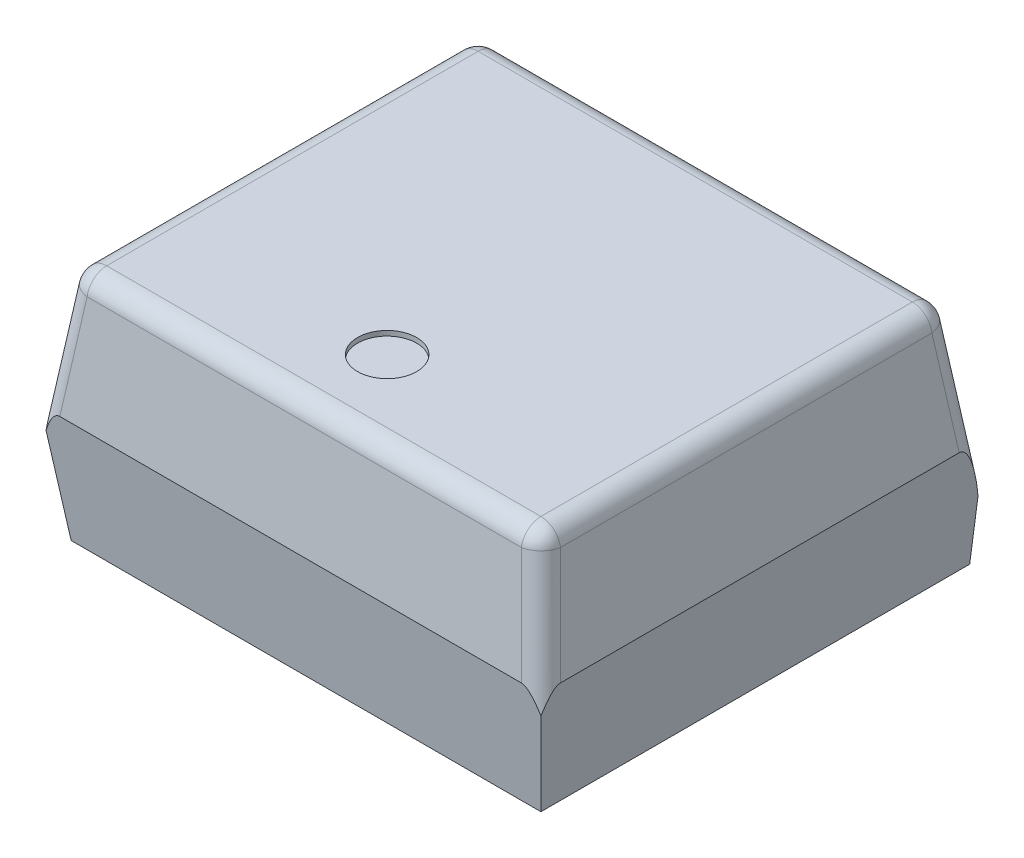
ISO-10303-21;
HEADER;
FILE_DESCRIPTION(('STEP AP214'),'2;1');
FILE_NAME('part.step','',(''),(''),'','','');
FILE_SCHEMA(('AUTOMOTIVE_DESIGN { 1 0 10303 214 1 1 1 1 }'));
ENDSEC;
DATA;
#1=APPLICATION_CONTEXT('core data for automotive mechanical design processes');
#2=APPLICATION_PROTOCOL_DEFINITION('international standard','automotive_design',2000,#1);
#3=PRODUCT_CONTEXT('',#1,'mechanical');
#4=PRODUCT('Part','Part','',(#3));
#5=PRODUCT_RELATED_PRODUCT_CATEGORY('part','',(#4));
#6=PRODUCT_DEFINITION_FORMATION('','',#4);
#7=PRODUCT_DEFINITION_CONTEXT('part definition',#1,'design');
#8=PRODUCT_DEFINITION('design','',#6,#7);
#9=PRODUCT_DEFINITION_SHAPE('','',#8);
#10=(LENGTH_UNIT() NAMED_UNIT(*) SI_UNIT(.MILLI.,.METRE.));
#11=(NAMED_UNIT(*) PLANE_ANGLE_UNIT() SI_UNIT($,.RADIAN.));
#12=(NAMED_UNIT(*) SI_UNIT($,.STERADIAN.) SOLID_ANGLE_UNIT());
#13=UNCERTAINTY_MEASURE_WITH_UNIT(LENGTH_MEASURE(1.E-05),#10,'distance_accuracy_value','');
#14=(GEOMETRIC_REPRESENTATION_CONTEXT(3) GLOBAL_UNCERTAINTY_ASSIGNED_CONTEXT((#13)) GLOBAL_UNIT_ASSIGNED_CONTEXT((#10,
#11,#12)) REPRESENTATION_CONTEXT('',''));
#15=CARTESIAN_POINT('',(0.,0.,0.));
#16=DIRECTION('',(0.,0.,1.));
#17=DIRECTION('',(1.,0.,0.));
#18=AXIS2_PLACEMENT_3D('',#15,#16,#17);
#19=CARTESIAN_POINT('',(-4.406529143216,2.051,0.));
#20=DIRECTION('',(0.,0.,0.999999999999986));
#21=DIRECTION('',(-0.659345815100005,0.751839807479021,0.));
#22=AXIS2_PLACEMENT_3D('',#19,#20,#21);
#23=CYLINDRICAL_SURFACE('',#22,0.4);
#24=CARTESIAN_POINT('',(-4.40652914321622,2.051,-3.834029143216));
#25=DIRECTION('',(0.,0.,0.999999999999986));
#26=DIRECTION('',(0.,1.,0.));
#27=AXIS2_PLACEMENT_3D('',#24,#25,#26);
#28=CIRCLE('',#27,0.4);
#29=CARTESIAN_POINT('',(-4.40652914321622,2.451,-3.834029143216));
#30=VERTEX_POINT('',#29);
#31=CARTESIAN_POINT('',(-4.803107087766,2.103210476888,-3.834029143216));
#32=VERTEX_POINT('',#31);
#33=EDGE_CURVE('E11',#30,#32,#28,.T.);
#34=ORIENTED_EDGE('',*,*,#33,.T.);
#35=DIRECTION('',(0.,0.,0.999999999999986));
#36=VECTOR('',#35,1.);
#37=CARTESIAN_POINT('',(-4.803107087766,2.103210476888,0.));
#38=LINE('',#37,#36);
#39=CARTESIAN_POINT('',(-4.80310708776578,2.103210476888,3.70402914321512));
#40=VERTEX_POINT('',#39);
#41=EDGE_CURVE('E27',#32,#40,#38,.T.);
#42=ORIENTED_EDGE('',*,*,#41,.T.);
#43=CARTESIAN_POINT('',(-4.406529143216,2.051,3.70402914321513));
#44=DIRECTION('',(0.,0.,-0.999999999999986));
#45=DIRECTION('',(-0.991444861373806,0.130526192219976,0.));
#46=AXIS2_PLACEMENT_3D('',#43,#44,#45);
#47=CIRCLE('',#46,0.4);
#48=CARTESIAN_POINT('',(-4.406529143216,2.451,3.70402914321513));
#49=VERTEX_POINT('',#48);
#50=EDGE_CURVE('E382',#40,#49,#47,.T.);
#51=ORIENTED_EDGE('',*,*,#50,.T.);
#52=DIRECTION('',(0.,0.,-0.999999999999986));
#53=VECTOR('',#52,1.);
#54=CARTESIAN_POINT('',(-4.406529143216,2.451,0.));
#55=LINE('',#54,#53);
#56=EDGE_CURVE('E216',#49,#30,#55,.T.);
#57=ORIENTED_EDGE('',*,*,#56,.T.);
#58=EDGE_LOOP('',(#34,#42,#51,#57));
#59=FACE_BOUND('',#58,.T.);
#60=ADVANCED_FACE('F16',(#59),#23,.T.);
#61=CARTESIAN_POINT('',(-5.08000000000022,2.051,-3.834029143216));
#62=DIRECTION('',(-0.999999999999986,0.,0.));
#63=DIRECTION('',(0.,0.751839807479021,-0.659345815100019));
#64=AXIS2_PLACEMENT_3D('',#61,#62,#63);
#65=CYLINDRICAL_SURFACE('',#64,0.4);
#66=CARTESIAN_POINT('',(4.40652914321589,2.051,-3.83402914321514));
#67=DIRECTION('',(-0.999999999999986,0.,0.));
#68=DIRECTION('',(0.,1.,0.));
#69=AXIS2_PLACEMENT_3D('',#66,#67,#68);
#70=CIRCLE('',#69,0.4);
#71=CARTESIAN_POINT('',(4.40652914321589,2.451,-3.83402914321514));
#72=VERTEX_POINT('',#71);
#73=CARTESIAN_POINT('',(4.40652914321589,2.103210476888,-4.23060708776513));
#74=VERTEX_POINT('',#73);
#75=EDGE_CURVE('E204',#72,#74,#70,.T.);
#76=ORIENTED_EDGE('',*,*,#75,.T.);
#77=DIRECTION('',(-0.999999999999986,0.,0.));
#78=VECTOR('',#77,1.);
#79=CARTESIAN_POINT('',(-5.07999999999978,2.103210476888,-4.230607087766));
#80=LINE('',#79,#78);
#81=CARTESIAN_POINT('',(-4.406529143216,2.103210476888,-4.230607087766));
#82=VERTEX_POINT('',#81);
#83=EDGE_CURVE('E217',#74,#82,#80,.T.);
#84=ORIENTED_EDGE('',*,*,#83,.T.);
#85=CARTESIAN_POINT('',(-4.40652914321622,2.051,-3.834029143216));
#86=DIRECTION('',(0.999999999999986,0.,0.));
#87=DIRECTION('',(0.,0.130526192219976,-0.991444861373806));
#88=AXIS2_PLACEMENT_3D('',#85,#86,#87);
#89=CIRCLE('',#88,0.4);
#90=EDGE_CURVE('E206',#82,#30,#89,.T.);
#91=ORIENTED_EDGE('',*,*,#90,.T.);
#92=DIRECTION('',(0.999999999999986,0.,0.));
#93=VECTOR('',#92,1.);
#94=CARTESIAN_POINT('',(-5.08000000000022,2.451,-3.834029143216));
#95=LINE('',#94,#93);
#96=EDGE_CURVE('E201',#30,#72,#95,.T.);
#97=ORIENTED_EDGE('',*,*,#96,.T.);
#98=EDGE_LOOP('',(#76,#84,#91,#97));
#99=FACE_BOUND('',#98,.T.);
#100=ADVANCED_FACE('F202',(#99),#65,.T.);
#101=CARTESIAN_POINT('',(-4.40652914321622,2.051,-3.834029143216));
#102=DIRECTION('',(0.,0.,0.999999999999986));
#103=DIRECTION('',(0.999999999999986,0.,0.));
#104=AXIS2_PLACEMENT_3D('',#101,#102,#103);
#105=SPHERICAL_SURFACE('',#104,0.4);
#106=ORIENTED_EDGE('',*,*,#90,.F.);
#107=CARTESIAN_POINT('',(-4.40652914321622,2.051,-3.834029143216));
#108=DIRECTION('',(0.129428307995397,0.983105602760403,0.129428307995397));
#109=DIRECTION('',(-0.695160638334369,0.183039268522097,-0.695160638334369));
#110=AXIS2_PLACEMENT_3D('',#107,#108,#109);
#111=CIRCLE('',#110,0.4);
#112=EDGE_CURVE('E41',#82,#32,#111,.T.);
#113=ORIENTED_EDGE('',*,*,#112,.T.);
#114=ORIENTED_EDGE('',*,*,#33,.F.);
#115=EDGE_LOOP('',(#106,#113,#114));
#116=FACE_BOUND('',#115,.T.);
#117=ADVANCED_FACE('F875',(#116),#105,.T.);
#118=CARTESIAN_POINT('',(4.406529143216,2.051,-8.74300631892311E-13));
#119=DIRECTION('',(0.,0.,-0.999999999999986));
#120=DIRECTION('',(0.659345815100005,0.751839807479021,0.));
#121=AXIS2_PLACEMENT_3D('',#118,#119,#120);
#122=CYLINDRICAL_SURFACE('',#121,0.4);
#123=CARTESIAN_POINT('',(4.40652914321589,2.051,3.70402914321601));
#124=DIRECTION('',(0.,0.,-0.999999999999986));
#125=DIRECTION('',(0.,1.,0.));
#126=AXIS2_PLACEMENT_3D('',#123,#124,#125);
#127=CIRCLE('',#126,0.4);
#128=CARTESIAN_POINT('',(4.40652914321589,2.451,3.70402914321601));
#129=VERTEX_POINT('',#128);
#130=CARTESIAN_POINT('',(4.80310708776589,2.103210476888,3.70402914321512));
#131=VERTEX_POINT('',#130);
#132=EDGE_CURVE('E367',#129,#131,#127,.T.);
#133=ORIENTED_EDGE('',*,*,#132,.T.);
#134=DIRECTION('',(0.,0.,-0.999999999999986));
#135=VECTOR('',#134,1.);
#136=CARTESIAN_POINT('',(4.80310708776578,2.103210476888,8.74300631892311E-13));
#137=LINE('',#136,#135);
#138=CARTESIAN_POINT('',(4.80310708776578,2.103210476888,-3.834029143216));
#139=VERTEX_POINT('',#138);
#140=EDGE_CURVE('E191',#131,#139,#137,.T.);
#141=ORIENTED_EDGE('',*,*,#140,.T.);
#142=CARTESIAN_POINT('',(4.40652914321589,2.051,-3.83402914321514));
#143=DIRECTION('',(0.,0.,0.999999999999986));
#144=DIRECTION('',(0.991444861373806,0.130526192219976,0.));
#145=AXIS2_PLACEMENT_3D('',#142,#143,#144);
#146=CIRCLE('',#145,0.4);
#147=EDGE_CURVE('E183',#139,#72,#146,.T.);
#148=ORIENTED_EDGE('',*,*,#147,.T.);
#149=DIRECTION('',(0.,0.,0.999999999999986));
#150=VECTOR('',#149,1.);
#151=CARTESIAN_POINT('',(4.406529143216,2.451,-8.74300631892311E-13));
#152=LINE('',#151,#150);
#153=EDGE_CURVE('E188',#72,#129,#152,.T.);
#154=ORIENTED_EDGE('',*,*,#153,.T.);
#155=EDGE_LOOP('',(#133,#141,#148,#154));
#156=FACE_BOUND('',#155,.T.);
#157=ADVANCED_FACE('F186',(#156),#122,.T.);
#158=CARTESIAN_POINT('',(4.40652914321589,2.051,-3.83402914321514));
#159=DIRECTION('',(0.,0.,0.999999999999986));
#160=DIRECTION('',(0.999999999999986,0.,0.));
#161=AXIS2_PLACEMENT_3D('',#158,#159,#160);
#162=SPHERICAL_SURFACE('',#161,0.4);
#163=ORIENTED_EDGE('',*,*,#147,.F.);
#164=CARTESIAN_POINT('',(4.40652914321589,2.051,-3.83402914321514));
#165=DIRECTION('',(-0.129428307995397,0.983105602760403,0.129428307995395));
#166=DIRECTION('',(0.695160638334369,0.183039268522097,-0.695160638334369));
#167=AXIS2_PLACEMENT_3D('',#164,#165,#166);
#168=CIRCLE('',#167,0.4);
#169=EDGE_CURVE('E213',#139,#74,#168,.T.);
#170=ORIENTED_EDGE('',*,*,#169,.T.);
#171=ORIENTED_EDGE('',*,*,#75,.F.);
#172=EDGE_LOOP('',(#163,#170,#171));
#173=FACE_BOUND('',#172,.T.);
#174=ADVANCED_FACE('F212',(#173),#162,.T.);
#175=CARTESIAN_POINT('',(-5.08,2.051,3.70402914321512));
#176=DIRECTION('',(0.999999999999986,0.,0.));
#177=DIRECTION('',(0.,0.751839807479021,0.659345815100005));
#178=AXIS2_PLACEMENT_3D('',#175,#176,#177);
#179=CYLINDRICAL_SURFACE('',#178,0.4);
#180=CARTESIAN_POINT('',(-4.406529143216,2.051,3.70402914321513));
#181=DIRECTION('',(0.999999999999986,0.,0.));
#182=DIRECTION('',(0.,1.,0.));
#183=AXIS2_PLACEMENT_3D('',#180,#181,#182);
#184=CIRCLE('',#183,0.4);
#185=CARTESIAN_POINT('',(-4.406529143216,2.103210476888,4.10060708776601));
#186=VERTEX_POINT('',#185);
#187=EDGE_CURVE('E229',#49,#186,#184,.T.);
#188=ORIENTED_EDGE('',*,*,#187,.T.);
#189=DIRECTION('',(0.999999999999986,0.,0.));
#190=VECTOR('',#189,1.);
#191=CARTESIAN_POINT('',(-5.08,2.103210476888,4.10060708776512));
#192=LINE('',#191,#190);
#193=CARTESIAN_POINT('',(4.40652914321589,2.103210476888,4.100607087766));
#194=VERTEX_POINT('',#193);
#195=EDGE_CURVE('E318',#186,#194,#192,.T.);
#196=ORIENTED_EDGE('',*,*,#195,.T.);
#197=CARTESIAN_POINT('',(4.40652914321589,2.051,3.70402914321601));
#198=DIRECTION('',(-0.999999999999986,0.,0.));
#199=DIRECTION('',(0.,0.130526192219976,0.991444861373806));
#200=AXIS2_PLACEMENT_3D('',#197,#198,#199);
#201=CIRCLE('',#200,0.4);
#202=EDGE_CURVE('E322',#194,#129,#201,.T.);
#203=ORIENTED_EDGE('',*,*,#202,.T.);
#204=DIRECTION('',(-0.999999999999986,0.,0.));
#205=VECTOR('',#204,1.);
#206=CARTESIAN_POINT('',(-5.08,2.451,3.70402914321512));
#207=LINE('',#206,#205);
#208=EDGE_CURVE('E222',#129,#49,#207,.T.);
#209=ORIENTED_EDGE('',*,*,#208,.T.);
#210=EDGE_LOOP('',(#188,#196,#203,#209));
#211=FACE_BOUND('',#210,.T.);
#212=ADVANCED_FACE('F851',(#211),#179,.T.);
#213=CARTESIAN_POINT('',(4.40652914321589,2.051,3.70402914321601));
#214=DIRECTION('',(0.,0.,0.999999999999986));
#215=DIRECTION('',(0.999999999999986,0.,0.));
#216=AXIS2_PLACEMENT_3D('',#213,#214,#215);
#217=SPHERICAL_SURFACE('',#216,0.4);
#218=ORIENTED_EDGE('',*,*,#202,.F.);
#219=CARTESIAN_POINT('',(4.40652914321589,2.051,3.70402914321601));
#220=DIRECTION('',(-0.129428307995397,0.983105602760403,-0.129428307995395));
#221=DIRECTION('',(0.695160638334369,0.183039268522097,0.695160638334369));
#222=AXIS2_PLACEMENT_3D('',#219,#220,#221);
#223=CIRCLE('',#222,0.4);
#224=EDGE_CURVE('E410',#194,#131,#223,.T.);
#225=ORIENTED_EDGE('',*,*,#224,.T.);
#226=ORIENTED_EDGE('',*,*,#132,.F.);
#227=EDGE_LOOP('',(#218,#225,#226));
#228=FACE_BOUND('',#227,.T.);
#229=ADVANCED_FACE('F843',(#228),#217,.T.);
#230=CARTESIAN_POINT('',(-4.406529143216,2.051,3.70402914321513));
#231=DIRECTION('',(0.,0.,0.999999999999986));
#232=DIRECTION('',(0.999999999999986,0.,0.));
#233=AXIS2_PLACEMENT_3D('',#230,#231,#232);
#234=SPHERICAL_SURFACE('',#233,0.4);
#235=ORIENTED_EDGE('',*,*,#50,.F.);
#236=CARTESIAN_POINT('',(-4.406529143216,2.051,3.70402914321513));
#237=DIRECTION('',(0.129428307995397,0.983105602760403,-0.129428307995397));
#238=DIRECTION('',(-0.695160638334369,0.183039268522097,0.695160638334369));
#239=AXIS2_PLACEMENT_3D('',#236,#237,#238);
#240=CIRCLE('',#239,0.4);
#241=EDGE_CURVE('E357',#40,#186,#240,.T.);
#242=ORIENTED_EDGE('',*,*,#241,.T.);
#243=ORIENTED_EDGE('',*,*,#187,.F.);
#244=EDGE_LOOP('',(#235,#242,#243));
#245=FACE_BOUND('',#244,.T.);
#246=ADVANCED_FACE('F526',(#245),#234,.T.);
#247=CARTESIAN_POINT('',(4.60496683550689,0.543716082658997,-4.032466835507));
#248=DIRECTION('',(0.129428307995397,-0.983105602760403,-0.129428307995395));
#249=DIRECTION('',(0.695160638334369,0.183039268522097,-0.695160638334369));
#250=AXIS2_PLACEMENT_3D('',#247,#248,#249);
#251=CYLINDRICAL_SURFACE('',#250,0.4);
#252=ORIENTED_EDGE('',*,*,#169,.F.);
#253=DIRECTION('',(0.129428307996028,-0.983105602760237,-0.129428307996026));
#254=VECTOR('',#253,1.);
#255=CARTESIAN_POINT('',(5.00154478005667,0.595926559547003,-4.03246683550613));
#256=LINE('',#255,#254);
#257=CARTESIAN_POINT('',(5.07999999999978,0.,-4.11092205545));
#258=VERTEX_POINT('',#257);
#259=EDGE_CURVE('E347',#139,#258,#256,.T.);
#260=ORIENTED_EDGE('',*,*,#259,.T.);
#261=CARTESIAN_POINT('',(4.87827420788378,-1.532259515108,-4.30577420788314));
#262=DIRECTION('',(-0.991444861373769,0.130526192220259,0.));
#263=DIRECTION('',(0.12935054531996,0.982514936595735,0.133913538492961));
#264=AXIS2_PLACEMENT_3D('',#261,#262,#263);
#265=ELLIPSE('',#264,1.558590970091,0.4);
#266=CARTESIAN_POINT('',(4.93516796659378,-1.10010851339556,-4.637835972612));
#267=VERTEX_POINT('',#266);
#268=EDGE_CURVE('E344',#258,#267,#265,.T.);
#269=ORIENTED_EDGE('',*,*,#268,.T.);
#270=CARTESIAN_POINT('',(5.21033597261156,-4.05451903021557,-4.637835972612));
#271=DIRECTION('',(0.,0.,0.999999999999986));
#272=DIRECTION('',(-0.130526192219973,0.99144486137382,0.));
#273=AXIS2_PLACEMENT_3D('',#270,#271,#272);
#274=ELLIPSE('',#273,3.09051401656,0.4);
#275=CARTESIAN_POINT('',(4.81375802806167,-0.989999999999561,-4.63783597261114));
#276=VERTEX_POINT('',#275);
#277=EDGE_CURVE('E304',#267,#276,#274,.T.);
#278=ORIENTED_EDGE('',*,*,#277,.T.);
#279=DIRECTION('',(-0.129428307996028,0.983105602760237,0.129428307996026));
#280=VECTOR('',#279,1.);
#281=CARTESIAN_POINT('',(4.60496683550689,0.59592655954744,-4.429044780057));
#282=LINE('',#281,#280);
#283=EDGE_CURVE('E301',#276,#74,#282,.T.);
#284=ORIENTED_EDGE('',*,*,#283,.T.);
#285=EDGE_LOOP('',(#252,#260,#269,#278,#284));
#286=FACE_BOUND('',#285,.T.);
#287=ADVANCED_FACE('F826',(#286),#251,.T.);
#288=CARTESIAN_POINT('',(5.07999999999978,4.37150315946155E-13,-4.5075));
#289=DIRECTION('',(0.991444861373806,0.130526192219976,0.));
#290=DIRECTION('',(0.,0.,-0.999999999999986));
#291=AXIS2_PLACEMENT_3D('',#288,#289,#290);
#292=PLANE('',#291);
#293=ORIENTED_EDGE('',*,*,#140,.F.);
#294=DIRECTION('',(-0.129428307996028,0.983105602760237,-0.129428307996026));
#295=VECTOR('',#294,1.);
#296=CARTESIAN_POINT('',(4.92712541095689,1.161197788458,3.82804746640526));
#297=LINE('',#296,#295);
#298=CARTESIAN_POINT('',(5.07999999999978,0.,3.98092205544912));
#299=VERTEX_POINT('',#298);
#300=EDGE_CURVE('E246',#299,#131,#297,.T.);
#301=ORIENTED_EDGE('',*,*,#300,.F.);
#302=DIRECTION('',(0.,0.,-0.999999999999986));
#303=VECTOR('',#302,1.);
#304=CARTESIAN_POINT('',(5.07999999999978,4.37150315946155E-13,-4.5075));
#305=LINE('',#304,#303);
#306=EDGE_CURVE('E305',#299,#258,#305,.T.);
#307=ORIENTED_EDGE('',*,*,#306,.T.);
#308=ORIENTED_EDGE('',*,*,#259,.F.);
#309=EDGE_LOOP('',(#293,#301,#307,#308));
#310=FACE_BOUND('',#309,.T.);
#311=ADVANCED_FACE('F817',(#310),#292,.T.);
#312=CARTESIAN_POINT('',(4.530547466407,1.10898731157,3.828047466407));
#313=DIRECTION('',(0.129428307995397,-0.983105602760403,0.129428307995395));
#314=DIRECTION('',(0.695160638334369,0.183039268522097,0.695160638334369));
#315=AXIS2_PLACEMENT_3D('',#312,#313,#314);
#316=CYLINDRICAL_SURFACE('',#315,0.4);
#317=ORIENTED_EDGE('',*,*,#224,.F.);
#318=DIRECTION('',(0.129428307996028,-0.983105602760237,0.129428307996026));
#319=VECTOR('',#318,1.);
#320=CARTESIAN_POINT('',(4.53054746640711,1.161197788458,4.224625410957));
#321=LINE('',#320,#319);
#322=CARTESIAN_POINT('',(4.68342205544989,0.,4.37750000000001));
#323=VERTEX_POINT('',#322);
#324=EDGE_CURVE('E397',#194,#323,#321,.T.);
#325=ORIENTED_EDGE('',*,*,#324,.T.);
#326=CARTESIAN_POINT('',(4.87827420788367,-1.532259515108,4.175774207884));
#327=DIRECTION('',(0.,0.130526192220259,-0.991444861373769));
#328=DIRECTION('',(-0.133913538492962,0.982514936595735,0.129350545319962));
#329=AXIS2_PLACEMENT_3D('',#326,#327,#328);
#330=ELLIPSE('',#329,1.558590970091,0.4);
#331=CARTESIAN_POINT('',(5.02212585092178,-0.439597805876997,4.31962585092201));
#332=VERTEX_POINT('',#331);
#333=EDGE_CURVE('E393',#323,#332,#330,.T.);
#334=ORIENTED_EDGE('',*,*,#333,.T.);
#335=CARTESIAN_POINT('',(4.87827420788367,-1.532259515108,4.175774207884));
#336=DIRECTION('',(-0.991444861373769,0.130526192220259,0.));
#337=DIRECTION('',(0.12935054531996,0.982514936595735,-0.133913538492961));
#338=AXIS2_PLACEMENT_3D('',#335,#336,#337);
#339=ELLIPSE('',#338,1.558590970091,0.4);
#340=EDGE_CURVE('E288',#332,#299,#339,.T.);
#341=ORIENTED_EDGE('',*,*,#340,.T.);
#342=ORIENTED_EDGE('',*,*,#300,.T.);
#343=EDGE_LOOP('',(#317,#325,#334,#341,#342));
#344=FACE_BOUND('',#343,.T.);
#345=ADVANCED_FACE('F809',(#344),#316,.T.);
#346=CARTESIAN_POINT('',(-5.08,0.,4.37749999999912));
#347=DIRECTION('',(0.,0.130526192219976,0.991444861373806));
#348=DIRECTION('',(0.999999999999986,0.,0.));
#349=AXIS2_PLACEMENT_3D('',#346,#347,#348);
#350=PLANE('',#349);
#351=ORIENTED_EDGE('',*,*,#195,.F.);
#352=DIRECTION('',(0.129428307996028,0.983105602760237,-0.129428307996028));
#353=VECTOR('',#352,1.);
#354=CARTESIAN_POINT('',(-4.615646035913,0.514809979146998,4.30972398046199));
#355=LINE('',#354,#353);
#356=CARTESIAN_POINT('',(-4.68342205545001,0.,4.37750000000001));
#357=VERTEX_POINT('',#356);
#358=EDGE_CURVE('E289',#357,#186,#355,.T.);
#359=ORIENTED_EDGE('',*,*,#358,.F.);
#360=DIRECTION('',(0.999999999999986,0.,0.));
#361=VECTOR('',#360,1.);
#362=CARTESIAN_POINT('',(-5.08,0.,4.37749999999912));
#363=LINE('',#362,#361);
#364=EDGE_CURVE('E237',#357,#323,#363,.T.);
#365=ORIENTED_EDGE('',*,*,#364,.T.);
#366=ORIENTED_EDGE('',*,*,#324,.F.);
#367=EDGE_LOOP('',(#351,#359,#365,#366));
#368=FACE_BOUND('',#367,.T.);
#369=ADVANCED_FACE('F523',(#368),#350,.T.);
#370=CARTESIAN_POINT('',(-5.07999999999978,2.451,4.5075));
#371=DIRECTION('',(0.,1.,0.));
#372=DIRECTION('',(0.999999999999986,0.,0.));
#373=AXIS2_PLACEMENT_3D('',#370,#371,#372);
#374=PLANE('',#373);
#375=ORIENTED_EDGE('',*,*,#56,.F.);
#376=ORIENTED_EDGE('',*,*,#208,.F.);
#377=ORIENTED_EDGE('',*,*,#153,.F.);
#378=ORIENTED_EDGE('',*,*,#96,.F.);
#379=EDGE_LOOP('',(#375,#376,#377,#378));
#380=FACE_BOUND('',#379,.T.);
#381=CARTESIAN_POINT('',(0.,2.451,2.41892237669));
#382=DIRECTION('',(0.,-1.,0.));
#383=DIRECTION('',(-0.999999999999986,0.,0.));
#384=AXIS2_PLACEMENT_3D('',#381,#382,#383);
#385=CIRCLE('',#384,0.6);
#386=CARTESIAN_POINT('',(0.599999999999891,2.451,2.41892237668825));
#387=VERTEX_POINT('',#386);
#388=EDGE_CURVE('E234',#387,#387,#385,.T.);
#389=ORIENTED_EDGE('',*,*,#388,.T.);
#390=EDGE_LOOP('',(#389));
#391=FACE_BOUND('',#390,.T.);
#392=ADVANCED_FACE('F18',(#380,#391),#374,.T.);
#393=CARTESIAN_POINT('',(-4.690065405013,-0.102671726651002,-4.11756540501212));
#394=DIRECTION('',(-0.129428307995397,-0.983105602760403,-0.129428307995397));
#395=DIRECTION('',(-0.695160638334369,0.183039268522097,-0.695160638334369));
#396=AXIS2_PLACEMENT_3D('',#393,#394,#395);
#397=CYLINDRICAL_SURFACE('',#396,0.4);
#398=ORIENTED_EDGE('',*,*,#112,.F.);
#399=DIRECTION('',(-0.129428307996028,-0.983105602760237,-0.129428307996028));
#400=VECTOR('',#399,1.);
#401=CARTESIAN_POINT('',(-4.69006540501321,-0.0504612497630244,-4.51414334956213));
#402=LINE('',#401,#400);
#403=CARTESIAN_POINT('',(-4.81375802806179,-0.989999999999561,-4.637835972612));
#404=VERTEX_POINT('',#403);
#405=EDGE_CURVE('E238',#82,#404,#402,.T.);
#406=ORIENTED_EDGE('',*,*,#405,.T.);
#407=CARTESIAN_POINT('',(-5.21033597261178,-4.05451903021557,-4.63783597261115));
#408=DIRECTION('',(0.,0.,0.999999999999986));
#409=DIRECTION('',(0.130526192219973,0.99144486137382,0.));
#410=AXIS2_PLACEMENT_3D('',#407,#408,#409);
#411=ELLIPSE('',#410,3.09051401656,0.4);
#412=CARTESIAN_POINT('',(-4.93516796659379,-1.10010851339556,-4.63783597261114));
#413=VERTEX_POINT('',#412);
#414=EDGE_CURVE('E249',#404,#413,#411,.T.);
#415=ORIENTED_EDGE('',*,*,#414,.T.);
#416=CARTESIAN_POINT('',(-4.87827420788378,-1.532259515108,-4.305774207884));
#417=DIRECTION('',(0.991444861373769,0.130526192220259,0.));
#418=DIRECTION('',(-0.12935054531996,0.982514936595735,0.133913538492962));
#419=AXIS2_PLACEMENT_3D('',#416,#417,#418);
#420=ELLIPSE('',#419,1.558590970091,0.4);
#421=CARTESIAN_POINT('',(-5.07999999999978,0.,-4.11092205545));
#422=VERTEX_POINT('',#421);
#423=EDGE_CURVE('E258',#413,#422,#420,.T.);
#424=ORIENTED_EDGE('',*,*,#423,.T.);
#425=DIRECTION('',(0.129428307996028,0.983105602760237,0.129428307996028));
#426=VECTOR('',#425,1.);
#427=CARTESIAN_POINT('',(-5.086643349563,-0.0504612497634616,-4.117565405013));
#428=LINE('',#427,#426);
#429=EDGE_CURVE('E390',#422,#32,#428,.T.);
#430=ORIENTED_EDGE('',*,*,#429,.T.);
#431=EDGE_LOOP('',(#398,#406,#415,#424,#430));
#432=FACE_BOUND('',#431,.T.);
#433=ADVANCED_FACE('F531',(#432),#397,.T.);
#434=CARTESIAN_POINT('',(-5.07999999999978,4.37150315946155E-13,-4.5075));
#435=DIRECTION('',(-0.991444861373806,0.130526192219976,0.));
#436=DIRECTION('',(0.,0.,0.999999999999986));
#437=AXIS2_PLACEMENT_3D('',#434,#435,#436);
#438=PLANE('',#437);
#439=ORIENTED_EDGE('',*,*,#41,.F.);
#440=ORIENTED_EDGE('',*,*,#429,.F.);
#441=DIRECTION('',(0.,0.,0.999999999999986));
#442=VECTOR('',#441,1.);
#443=CARTESIAN_POINT('',(-5.07999999999978,4.37150315946155E-13,-4.5075));
#444=LINE('',#443,#442);
#445=CARTESIAN_POINT('',(-5.07999999999978,0.,3.98092205544912));
#446=VERTEX_POINT('',#445);
#447=EDGE_CURVE('E386',#422,#446,#444,.T.);
#448=ORIENTED_EDGE('',*,*,#447,.T.);
#449=DIRECTION('',(-0.129428307996028,-0.983105602760237,0.129428307996028));
#450=VECTOR('',#449,1.);
#451=CARTESIAN_POINT('',(-5.01222398046179,0.514809979146998,3.91314603591213));
#452=LINE('',#451,#450);
#453=EDGE_CURVE('E338',#40,#446,#452,.T.);
#454=ORIENTED_EDGE('',*,*,#453,.F.);
#455=EDGE_LOOP('',(#439,#440,#448,#454));
#456=FACE_BOUND('',#455,.T.);
#457=ADVANCED_FACE('F529',(#456),#438,.T.);
#458=CARTESIAN_POINT('',(-5.07999999999978,4.37150315946155E-13,-4.5075));
#459=DIRECTION('',(-0.991444861373806,-0.130526192219976,0.));
#460=DIRECTION('',(-0.130526192219973,0.99144486137382,0.));
#461=AXIS2_PLACEMENT_3D('',#458,#459,#460);
#462=PLANE('',#461);
#463=ORIENTED_EDGE('',*,*,#423,.F.);
#464=DIRECTION('',(0.130526192219973,-0.99144486137382,0.));
#465=VECTOR('',#464,1.);
#466=CARTESIAN_POINT('',(-4.92496357075878,-1.17761859503256,-4.637835972612));
#467=LINE('',#466,#465);
#468=CARTESIAN_POINT('',(-4.76681187348921,-2.37889999999957,-4.637835972612));
#469=VERTEX_POINT('',#468);
#470=EDGE_CURVE('E232',#413,#469,#467,.T.);
#471=ORIENTED_EDGE('',*,*,#470,.T.);
#472=DIRECTION('',(0.,0.,0.999999999999986));
#473=VECTOR('',#472,1.);
#474=CARTESIAN_POINT('',(-4.766811873489,-2.3789,-2.13111952145513));
#475=LINE('',#474,#473);
#476=CARTESIAN_POINT('',(-4.76681187348878,-2.3789,4.06431187348813));
#477=VERTEX_POINT('',#476);
#478=EDGE_CURVE('E337',#469,#477,#475,.T.);
#479=ORIENTED_EDGE('',*,*,#478,.T.);
#480=DIRECTION('',(-0.129428307996028,0.983105602760237,0.129428307996026));
#481=VECTOR('',#480,1.);
#482=CARTESIAN_POINT('',(-4.92898354250078,-1.147083878137,4.22648354250099));
#483=LINE('',#482,#481);
#484=CARTESIAN_POINT('',(-5.02212585092178,-0.439597805876997,4.31962585092201));
#485=VERTEX_POINT('',#484);
#486=EDGE_CURVE('E333',#477,#485,#483,.T.);
#487=ORIENTED_EDGE('',*,*,#486,.T.);
#488=CARTESIAN_POINT('',(-4.87827420788378,-1.532259515108,4.17577420788315));
#489=DIRECTION('',(0.991444861373769,0.130526192220259,0.));
#490=DIRECTION('',(-0.12935054531996,0.982514936595735,-0.133913538492962));
#491=AXIS2_PLACEMENT_3D('',#488,#489,#490);
#492=ELLIPSE('',#491,1.558590970091,0.4);
#493=EDGE_CURVE('E298',#446,#485,#492,.T.);
#494=ORIENTED_EDGE('',*,*,#493,.F.);
#495=ORIENTED_EDGE('',*,*,#447,.F.);
#496=EDGE_LOOP('',(#463,#471,#479,#487,#494,#495));
#497=FACE_BOUND('',#496,.T.);
#498=ADVANCED_FACE('F516',(#497),#462,.T.);
#499=CARTESIAN_POINT('',(-4.615646035913,0.462599502258999,3.91314603591213));
#500=DIRECTION('',(-0.129428307995397,-0.983105602760403,0.129428307995397));
#501=DIRECTION('',(-0.695160638334369,0.183039268522097,0.695160638334369));
#502=AXIS2_PLACEMENT_3D('',#499,#500,#501);
#503=CYLINDRICAL_SURFACE('',#502,0.4);
#504=ORIENTED_EDGE('',*,*,#241,.F.);
#505=ORIENTED_EDGE('',*,*,#453,.T.);
#506=ORIENTED_EDGE('',*,*,#493,.T.);
#507=CARTESIAN_POINT('',(-4.87827420788378,-1.532259515108,4.17577420788315));
#508=DIRECTION('',(0.,0.130526192220259,-0.991444861373769));
#509=DIRECTION('',(0.133913538492961,0.982514936595735,0.129350545319962));
#510=AXIS2_PLACEMENT_3D('',#507,#508,#509);
#511=ELLIPSE('',#510,1.558590970091,0.4);
#512=EDGE_CURVE('E292',#485,#357,#511,.T.);
#513=ORIENTED_EDGE('',*,*,#512,.T.);
#514=ORIENTED_EDGE('',*,*,#358,.T.);
#515=EDGE_LOOP('',(#504,#505,#506,#513,#514));
#516=FACE_BOUND('',#515,.T.);
#517=ADVANCED_FACE('F512',(#516),#503,.T.);
#518=CARTESIAN_POINT('',(5.07999999999978,4.37150315946155E-13,-4.5075));
#519=DIRECTION('',(0.991444861373806,-0.130526192219976,0.));
#520=DIRECTION('',(0.,0.,-0.999999999999986));
#521=AXIS2_PLACEMENT_3D('',#518,#519,#520);
#522=PLANE('',#521);
#523=ORIENTED_EDGE('',*,*,#340,.F.);
#524=DIRECTION('',(0.129428307996028,0.983105602760237,0.129428307996028));
#525=VECTOR('',#524,1.);
#526=CARTESIAN_POINT('',(4.90980286098767,-1.292775618622,4.207302860988));
#527=LINE('',#526,#525);
#528=CARTESIAN_POINT('',(4.76681187348878,-2.3789,4.064311873489));
#529=VERTEX_POINT('',#528);
#530=EDGE_CURVE('E306',#529,#332,#527,.T.);
#531=ORIENTED_EDGE('',*,*,#530,.F.);
#532=DIRECTION('',(0.,0.,-0.999999999999986));
#533=VECTOR('',#532,1.);
#534=CARTESIAN_POINT('',(4.76681187348878,-2.3789,-2.13111952145599));
#535=LINE('',#534,#533);
#536=CARTESIAN_POINT('',(4.76681187348889,-2.37889999999957,-4.63783597261201));
#537=VERTEX_POINT('',#536);
#538=EDGE_CURVE('E293',#529,#537,#535,.T.);
#539=ORIENTED_EDGE('',*,*,#538,.T.);
#540=DIRECTION('',(0.130526192219973,0.99144486137382,0.));
#541=VECTOR('',#540,1.);
#542=CARTESIAN_POINT('',(4.84063571481867,-1.81815225360656,-4.637835972612));
#543=LINE('',#542,#541);
#544=EDGE_CURVE('E418',#537,#267,#543,.T.);
#545=ORIENTED_EDGE('',*,*,#544,.T.);
#546=ORIENTED_EDGE('',*,*,#268,.F.);
#547=ORIENTED_EDGE('',*,*,#306,.F.);
#548=EDGE_LOOP('',(#523,#531,#539,#545,#546,#547));
#549=FACE_BOUND('',#548,.T.);
#550=ADVANCED_FACE('F755',(#549),#522,.T.);
#551=CARTESIAN_POINT('',(-5.08,0.,4.37749999999912));
#552=DIRECTION('',(0.,-0.130526192219976,0.991444861373806));
#553=DIRECTION('',(-0.999999999999986,0.,0.));
#554=AXIS2_PLACEMENT_3D('',#551,#552,#553);
#555=PLANE('',#554);
#556=ORIENTED_EDGE('',*,*,#512,.F.);
#557=ORIENTED_EDGE('',*,*,#486,.F.);
#558=DIRECTION('',(0.999999999999986,0.,0.));
#559=VECTOR('',#558,1.);
#560=CARTESIAN_POINT('',(-2.06582882909722,-2.3789,4.06431187348813));
#561=LINE('',#560,#559);
#562=EDGE_CURVE('E20',#477,#529,#561,.T.);
#563=ORIENTED_EDGE('',*,*,#562,.T.);
#564=ORIENTED_EDGE('',*,*,#530,.T.);
#565=ORIENTED_EDGE('',*,*,#333,.F.);
#566=ORIENTED_EDGE('',*,*,#364,.F.);
#567=EDGE_LOOP('',(#556,#557,#563,#564,#565,#566));
#568=FACE_BOUND('',#567,.T.);
#569=ADVANCED_FACE('F519',(#568),#555,.T.);
#570=CARTESIAN_POINT('',(-5.07999999999978,4.37150315946155E-13,-4.5075));
#571=DIRECTION('',(0.,0.130526192219976,-0.991444861373806));
#572=DIRECTION('',(-0.999999999999986,0.,0.));
#573=AXIS2_PLACEMENT_3D('',#570,#571,#572);
#574=PLANE('',#573);
#575=ORIENTED_EDGE('',*,*,#83,.F.);
#576=ORIENTED_EDGE('',*,*,#283,.F.);
#577=DIRECTION('',(-0.999999999999986,0.,0.));
#578=VECTOR('',#577,1.);
#579=CARTESIAN_POINT('',(7.83792434831367,-0.989999999999561,-4.637835972612));
#580=LINE('',#579,#578);
#581=CARTESIAN_POINT('',(3.10999999999967,-0.989999999999561,-4.637835972612));
#582=VERTEX_POINT('',#581);
#583=EDGE_CURVE('E310',#276,#582,#580,.T.);
#584=ORIENTED_EDGE('',*,*,#583,.T.);
#585=DIRECTION('',(0.,0.99144486137382,0.130526192219973));
#586=VECTOR('',#585,1.);
#587=CARTESIAN_POINT('',(3.10999999999978,-0.840485049759566,-4.618151955986));
#588=LINE('',#587,#586);
#589=CARTESIAN_POINT('',(3.10999999999978,-0.983899999999566,-4.63703289237601));
#590=VERTEX_POINT('',#589);
#591=EDGE_CURVE('E282',#582,#590,#588,.T.);
#592=ORIENTED_EDGE('',*,*,#591,.T.);
#593=DIRECTION('',(-0.999999999999986,0.,0.));
#594=VECTOR('',#593,1.);
#595=CARTESIAN_POINT('',(-1.650416623208,-0.983899999999566,-4.63703289237687));
#596=LINE('',#595,#594);
#597=CARTESIAN_POINT('',(-3.11,-0.983899999999566,-4.63703289237513));
#598=VERTEX_POINT('',#597);
#599=EDGE_CURVE('E279',#590,#598,#596,.T.);
#600=ORIENTED_EDGE('',*,*,#599,.T.);
#601=DIRECTION('',(0.,-0.99144486137382,-0.130526192219973));
#602=VECTOR('',#601,1.);
#603=CARTESIAN_POINT('',(-3.10999999999999,-1.28435971210956,-4.67658916389913));
#604=LINE('',#603,#602);
#605=CARTESIAN_POINT('',(-3.11,-0.989999999999561,-4.63783597261114));
#606=VERTEX_POINT('',#605);
#607=EDGE_CURVE('E283',#598,#606,#604,.T.);
#608=ORIENTED_EDGE('',*,*,#607,.T.);
#609=DIRECTION('',(-0.999999999999986,0.,0.));
#610=VECTOR('',#609,1.);
#611=CARTESIAN_POINT('',(7.83792434831367,-0.989999999999561,-4.637835972612));
#612=LINE('',#611,#610);
#613=EDGE_CURVE('E261',#606,#404,#612,.T.);
#614=ORIENTED_EDGE('',*,*,#613,.T.);
#615=ORIENTED_EDGE('',*,*,#405,.F.);
#616=EDGE_LOOP('',(#575,#576,#584,#592,#600,#608,#614,#615));
#617=FACE_BOUND('',#616,.T.);
#618=ADVANCED_FACE('F478',(#617),#574,.T.);
#619=CARTESIAN_POINT('',(-4.94966402738778,-2.37889999999957,-4.637835972612));
#620=DIRECTION('',(0.,0.,0.999999999999986));
#621=DIRECTION('',(0.999999999999986,0.,0.));
#622=AXIS2_PLACEMENT_3D('',#619,#620,#621);
#623=PLANE('',#622);
#624=ORIENTED_EDGE('',*,*,#277,.F.);
#625=ORIENTED_EDGE('',*,*,#544,.F.);
#626=DIRECTION('',(0.999999999999986,0.,0.));
#627=VECTOR('',#626,1.);
#628=CARTESIAN_POINT('',(-2.00066084279178,-2.37889999999957,-4.63783597261114));
#629=LINE('',#628,#627);
#630=CARTESIAN_POINT('',(3.10999999999967,-2.37889999999957,-4.637835972612));
#631=VERTEX_POINT('',#630);
#632=EDGE_CURVE('E274',#631,#537,#629,.T.);
#633=ORIENTED_EDGE('',*,*,#632,.F.);
#634=DIRECTION('',(0.,1.,0.));
#635=VECTOR('',#634,1.);
#636=CARTESIAN_POINT('',(3.10999999999967,-2.37889999999957,-4.637835972612));
#637=LINE('',#636,#635);
#638=EDGE_CURVE('E264',#631,#582,#637,.T.);
#639=ORIENTED_EDGE('',*,*,#638,.T.);
#640=ORIENTED_EDGE('',*,*,#583,.F.);
#641=EDGE_LOOP('',(#624,#625,#633,#639,#640));
#642=FACE_BOUND('',#641,.T.);
#643=ADVANCED_FACE('F480',(#642),#623,.F.);
#644=CARTESIAN_POINT('',(0.,2.451,2.41892237669));
#645=DIRECTION('',(0.,-1.,0.));
#646=DIRECTION('',(-0.999999999999986,0.,0.));
#647=AXIS2_PLACEMENT_3D('',#644,#645,#646);
#648=CYLINDRICAL_SURFACE('',#647,0.6);
#649=CARTESIAN_POINT('',(0.599999999999891,2.451,2.41892237668825));
#650=CARTESIAN_POINT('',(0.599999999999891,2.351,2.41892237668825));
#651=(BOUNDED_CURVE() B_SPLINE_CURVE(1,(#649,#650),.UNSPECIFIED.,.F.,
.F.) B_SPLINE_CURVE_WITH_KNOTS((2,2),(0.,0.1),
.UNSPECIFIED.) CURVE() GEOMETRIC_REPRESENTATION_ITEM() RATIONAL_B_SPLINE_CURVE((1.,1.)) REPRESENTATION_ITEM(''));
#652=CARTESIAN_POINT('',(0.599999999999891,2.351,2.41892237668825));
#653=VERTEX_POINT('',#652);
#654=EDGE_CURVE('E268',#387,#653,#651,.T.);
#655=ORIENTED_EDGE('',*,*,#654,.F.);
#656=ORIENTED_EDGE('',*,*,#388,.F.);
#657=ORIENTED_EDGE('',*,*,#654,.T.);
#658=CARTESIAN_POINT('',(0.,2.351,2.41892237669));
#659=DIRECTION('',(0.,-1.,0.));
#660=DIRECTION('',(-0.999999999999986,0.,0.));
#661=AXIS2_PLACEMENT_3D('',#658,#659,#660);
#662=CIRCLE('',#661,0.6);
#663=EDGE_CURVE('E70',#653,#653,#662,.T.);
#664=ORIENTED_EDGE('',*,*,#663,.T.);
#665=EDGE_LOOP('',(#655,#656,#657,#664));
#666=FACE_BOUND('',#665,.T.);
#667=ADVANCED_FACE('F720',(#666),#648,.F.);
#668=CARTESIAN_POINT('',(0.,2.351,2.41892237669));
#669=DIRECTION('',(0.,1.,0.));
#670=DIRECTION('',(0.999999999999986,0.,0.));
#671=AXIS2_PLACEMENT_3D('',#668,#669,#670);
#672=PLANE('',#671);
#673=ORIENTED_EDGE('',*,*,#663,.F.);
#674=EDGE_LOOP('',(#673));
#675=FACE_BOUND('',#674,.T.);
#676=ADVANCED_FACE('F709',(#675),#672,.T.);
#677=CARTESIAN_POINT('',(3.10999999999989,-2.3789,0.57249999999999));
#678=DIRECTION('',(0.999999999999986,0.,0.));
#679=DIRECTION('',(0.,0.,-0.999999999999986));
#680=AXIS2_PLACEMENT_3D('',#677,#678,#679);
#681=PLANE('',#680);
#682=ORIENTED_EDGE('',*,*,#591,.F.);
#683=ORIENTED_EDGE('',*,*,#638,.F.);
#684=DIRECTION('',(0.,0.,-0.999999999999986));
#685=VECTOR('',#684,1.);
#686=CARTESIAN_POINT('',(3.10999999999978,-2.3789,0.408880478543996));
#687=LINE('',#686,#685);
#688=CARTESIAN_POINT('',(3.10999999999989,-2.3789,0.57249999999999));
#689=VERTEX_POINT('',#688);
#690=EDGE_CURVE('E86',#689,#631,#687,.T.);
#691=ORIENTED_EDGE('',*,*,#690,.F.);
#692=DIRECTION('',(0.,1.,0.));
#693=VECTOR('',#692,1.);
#694=CARTESIAN_POINT('',(3.10999999999989,-2.3789,0.57249999999999));
#695=LINE('',#694,#693);
#696=CARTESIAN_POINT('',(3.10999999999989,-0.983900000000003,0.57249999999999));
#697=VERTEX_POINT('',#696);
#698=EDGE_CURVE('E275',#689,#697,#695,.T.);
#699=ORIENTED_EDGE('',*,*,#698,.T.);
#700=DIRECTION('',(0.,0.,-0.999999999999986));
#701=VECTOR('',#700,1.);
#702=CARTESIAN_POINT('',(3.10999999999989,-0.983899999999566,-6.2875));
#703=LINE('',#702,#701);
#704=EDGE_CURVE('E278',#697,#590,#703,.T.);
#705=ORIENTED_EDGE('',*,*,#704,.T.);
#706=EDGE_LOOP('',(#682,#683,#691,#699,#705));
#707=FACE_BOUND('',#706,.T.);
#708=ADVANCED_FACE('F474',(#707),#681,.F.);
#709=CARTESIAN_POINT('',(1.77916675358278,-0.983899999999566,-6.56286337769486));
#710=DIRECTION('',(0.,1.,0.));
#711=DIRECTION('',(0.999999999999986,0.,0.));
#712=AXIS2_PLACEMENT_3D('',#709,#710,#711);
#713=PLANE('',#712);
#714=ORIENTED_EDGE('',*,*,#599,.F.);
#715=ORIENTED_EDGE('',*,*,#704,.F.);
#716=DIRECTION('',(0.999999999999986,0.,0.));
#717=VECTOR('',#716,1.);
#718=CARTESIAN_POINT('',(3.10999999999989,-0.983900000000003,0.57249999999999));
#719=LINE('',#718,#717);
#720=CARTESIAN_POINT('',(-3.10999999999956,-0.983900000000003,0.572499999999129));
#721=VERTEX_POINT('',#720);
#722=EDGE_CURVE('E269',#721,#697,#719,.T.);
#723=ORIENTED_EDGE('',*,*,#722,.F.);
#724=DIRECTION('',(0.,0.,0.999999999999986));
#725=VECTOR('',#724,1.);
#726=CARTESIAN_POINT('',(-3.10999999999956,-0.983900000000003,0.572499999999129));
#727=LINE('',#726,#725);
#728=EDGE_CURVE('E317',#598,#721,#727,.T.);
#729=ORIENTED_EDGE('',*,*,#728,.F.);
#730=EDGE_LOOP('',(#714,#715,#723,#729));
#731=FACE_BOUND('',#730,.T.);
#732=ADVANCED_FACE('F476',(#731),#713,.F.);
#733=CARTESIAN_POINT('',(-3.11,-2.37889999999957,-6.2875));
#734=DIRECTION('',(-0.999999999999986,0.,0.));
#735=DIRECTION('',(0.,1.,0.));
#736=AXIS2_PLACEMENT_3D('',#733,#734,#735);
#737=PLANE('',#736);
#738=ORIENTED_EDGE('',*,*,#607,.F.);
#739=ORIENTED_EDGE('',*,*,#728,.T.);
#740=DIRECTION('',(0.,1.,0.));
#741=VECTOR('',#740,1.);
#742=CARTESIAN_POINT('',(-3.10999999999956,-2.3789,0.572499999999129));
#743=LINE('',#742,#741);
#744=CARTESIAN_POINT('',(-3.10999999999956,-2.3789,0.572499999999129));
#745=VERTEX_POINT('',#744);
#746=EDGE_CURVE('E273',#745,#721,#743,.T.);
#747=ORIENTED_EDGE('',*,*,#746,.F.);
#748=DIRECTION('',(0.,0.,0.999999999999986));
#749=VECTOR('',#748,1.);
#750=CARTESIAN_POINT('',(-3.11,-2.3789,-3.02111952145513));
#751=LINE('',#750,#749);
#752=CARTESIAN_POINT('',(-3.11,-2.37889999999957,-4.63783597261114));
#753=VERTEX_POINT('',#752);
#754=EDGE_CURVE('E438',#753,#745,#751,.T.);
#755=ORIENTED_EDGE('',*,*,#754,.F.);
#756=DIRECTION('',(0.,-1.,0.));
#757=VECTOR('',#756,1.);
#758=CARTESIAN_POINT('',(-3.11,-2.37889999999957,-4.63783597261114));
#759=LINE('',#758,#757);
#760=EDGE_CURVE('E326',#606,#753,#759,.T.);
#761=ORIENTED_EDGE('',*,*,#760,.F.);
#762=EDGE_LOOP('',(#738,#739,#747,#755,#761));
#763=FACE_BOUND('',#762,.T.);
#764=ADVANCED_FACE('F470',(#763),#737,.F.);
#765=CARTESIAN_POINT('',(-4.94966402738778,-2.37889999999957,-4.637835972612));
#766=DIRECTION('',(0.,0.,0.999999999999986));
#767=DIRECTION('',(0.999999999999986,0.,0.));
#768=AXIS2_PLACEMENT_3D('',#765,#766,#767);
#769=PLANE('',#768);
#770=ORIENTED_EDGE('',*,*,#414,.F.);
#771=ORIENTED_EDGE('',*,*,#613,.F.);
#772=ORIENTED_EDGE('',*,*,#760,.T.);
#773=DIRECTION('',(0.999999999999986,0.,0.));
#774=VECTOR('',#773,1.);
#775=CARTESIAN_POINT('',(-2.00066084279178,-2.37889999999957,-4.63783597261114));
#776=LINE('',#775,#774);
#777=EDGE_CURVE('E435',#469,#753,#776,.T.);
#778=ORIENTED_EDGE('',*,*,#777,.F.);
#779=ORIENTED_EDGE('',*,*,#470,.F.);
#780=EDGE_LOOP('',(#770,#771,#772,#778,#779));
#781=FACE_BOUND('',#780,.T.);
#782=ADVANCED_FACE('F533',(#781),#769,.F.);
#783=CARTESIAN_POINT('',(-3.10999999999956,-2.3789,0.572499999999129));
#784=DIRECTION('',(0.,0.,0.999999999999986));
#785=DIRECTION('',(0.999999999999986,0.,0.));
#786=AXIS2_PLACEMENT_3D('',#783,#784,#785);
#787=PLANE('',#786);
#788=DIRECTION('',(0.999999999999986,0.,0.));
#789=VECTOR('',#788,1.);
#790=CARTESIAN_POINT('',(-1.080828829097,-2.3789,0.572500000000004));
#791=LINE('',#790,#789);
#792=EDGE_CURVE('E313',#745,#689,#791,.T.);
#793=ORIENTED_EDGE('',*,*,#792,.F.);
#794=ORIENTED_EDGE('',*,*,#746,.T.);
#795=ORIENTED_EDGE('',*,*,#722,.T.);
#796=ORIENTED_EDGE('',*,*,#698,.F.);
#797=EDGE_LOOP('',(#793,#794,#795,#796));
#798=FACE_BOUND('',#797,.T.);
#799=ADVANCED_FACE('F473',(#798),#787,.F.);
#800=CARTESIAN_POINT('',(0.948342341804784,-2.3789,0.245260957088864));
#801=DIRECTION('',(0.,1.,0.));
#802=DIRECTION('',(0.999999999999986,0.,0.));
#803=AXIS2_PLACEMENT_3D('',#800,#801,#802);
#804=PLANE('',#803);
#805=ORIENTED_EDGE('',*,*,#632,.T.);
#806=ORIENTED_EDGE('',*,*,#538,.F.);
#807=ORIENTED_EDGE('',*,*,#562,.F.);
#808=ORIENTED_EDGE('',*,*,#478,.F.);
#809=ORIENTED_EDGE('',*,*,#777,.T.);
#810=ORIENTED_EDGE('',*,*,#754,.T.);
#811=ORIENTED_EDGE('',*,*,#792,.T.);
#812=ORIENTED_EDGE('',*,*,#690,.T.);
#813=EDGE_LOOP('',(#805,#806,#807,#808,#809,#810,#811,#812));
#814=FACE_BOUND('',#813,.T.);
#815=ADVANCED_FACE('F465',(#814),#804,.F.);
#816=CLOSED_SHELL('',(#60,#100,#117,#157,#174,#212,#229,#246,#287,#311,#345,#369,#392,#433,#457,
#498,#517,#550,#569,#618,#643,#667,#676,#708,#732,#764,#782,#799,#815));
#817=MANIFOLD_SOLID_BREP('B1',#816);
#818=ADVANCED_BREP_SHAPE_REPRESENTATION('',(#18,#817),#14);
#819=SHAPE_DEFINITION_REPRESENTATION(#9,#818);
ENDSEC;
END-ISO-10303-21;
